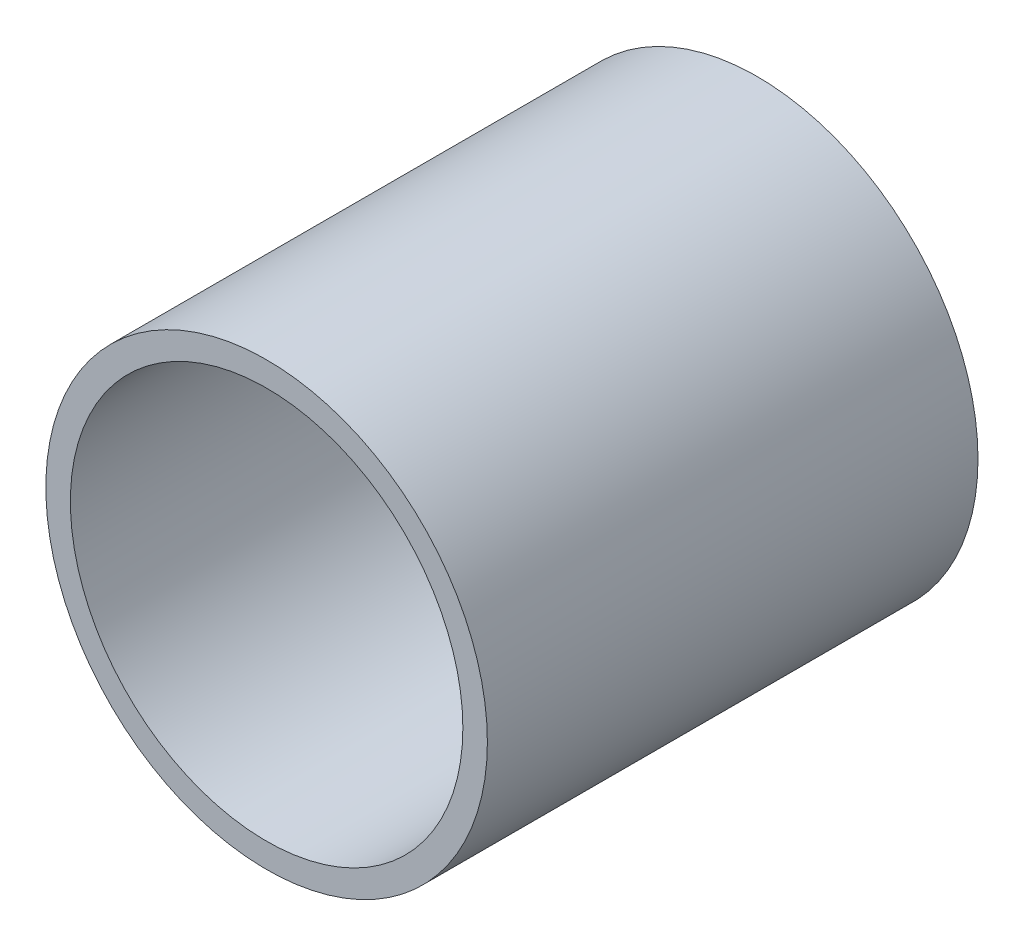
ISO-10303-21;
HEADER;
FILE_DESCRIPTION(('STEP AP214'),'2;1');
FILE_NAME('part.step','',(''),(''),'','','');
FILE_SCHEMA(('AUTOMOTIVE_DESIGN { 1 0 10303 214 1 1 1 1 }'));
ENDSEC;
DATA;
#1=APPLICATION_CONTEXT('core data for automotive mechanical design processes');
#2=APPLICATION_PROTOCOL_DEFINITION('international standard','automotive_design',2000,#1);
#3=PRODUCT_CONTEXT('',#1,'mechanical');
#4=PRODUCT('Part','Part','',(#3));
#5=PRODUCT_RELATED_PRODUCT_CATEGORY('part','',(#4));
#6=PRODUCT_DEFINITION_FORMATION('','',#4);
#7=PRODUCT_DEFINITION_CONTEXT('part definition',#1,'design');
#8=PRODUCT_DEFINITION('design','',#6,#7);
#9=PRODUCT_DEFINITION_SHAPE('','',#8);
#10=(LENGTH_UNIT() NAMED_UNIT(*) SI_UNIT(.MILLI.,.METRE.));
#11=(NAMED_UNIT(*) PLANE_ANGLE_UNIT() SI_UNIT($,.RADIAN.));
#12=(NAMED_UNIT(*) SI_UNIT($,.STERADIAN.) SOLID_ANGLE_UNIT());
#13=UNCERTAINTY_MEASURE_WITH_UNIT(LENGTH_MEASURE(1.E-05),#10,'distance_accuracy_value','');
#14=(GEOMETRIC_REPRESENTATION_CONTEXT(3) GLOBAL_UNCERTAINTY_ASSIGNED_CONTEXT((#13)) GLOBAL_UNIT_ASSIGNED_CONTEXT((#10,
#11,#12)) REPRESENTATION_CONTEXT('',''));
#15=CARTESIAN_POINT('',(0.,0.,0.));
#16=DIRECTION('',(0.,0.,1.));
#17=DIRECTION('',(1.,0.,0.));
#18=AXIS2_PLACEMENT_3D('',#15,#16,#17);
#19=CARTESIAN_POINT('',(0.,0.,31.75));
#20=DIRECTION('',(0.,0.,1.));
#21=DIRECTION('',(1.,0.,0.));
#22=AXIS2_PLACEMENT_3D('',#19,#20,#21);
#23=PLANE('',#22);
#24=CARTESIAN_POINT('',(0.,0.,31.75));
#25=DIRECTION('',(0.,0.,1.));
#26=DIRECTION('',(1.,0.,0.));
#27=AXIS2_PLACEMENT_3D('',#24,#25,#26);
#28=CIRCLE('',#27,28.575);
#29=CARTESIAN_POINT('',(28.575,0.,31.75));
#30=VERTEX_POINT('',#29);
#31=EDGE_CURVE('E10',#30,#30,#28,.T.);
#32=ORIENTED_EDGE('',*,*,#31,.T.);
#33=EDGE_LOOP('',(#32));
#34=FACE_BOUND('',#33,.T.);
#35=CARTESIAN_POINT('',(0.,0.,31.75));
#36=DIRECTION('',(0.,0.,1.));
#37=DIRECTION('',(1.,0.,0.));
#38=AXIS2_PLACEMENT_3D('',#35,#36,#37);
#39=CIRCLE('',#38,25.4);
#40=CARTESIAN_POINT('',(25.4,0.,31.75));
#41=VERTEX_POINT('',#40);
#42=EDGE_CURVE('E41',#41,#41,#39,.T.);
#43=ORIENTED_EDGE('',*,*,#42,.F.);
#44=EDGE_LOOP('',(#43));
#45=FACE_BOUND('',#44,.T.);
#46=ADVANCED_FACE('F30',(#34,#45),#23,.T.);
#47=CARTESIAN_POINT('',(0.,0.,-31.75));
#48=DIRECTION('',(0.,0.,1.));
#49=DIRECTION('',(1.,0.,0.));
#50=AXIS2_PLACEMENT_3D('',#47,#48,#49);
#51=PLANE('',#50);
#52=CARTESIAN_POINT('',(0.,0.,-31.75));
#53=DIRECTION('',(0.,0.,1.));
#54=DIRECTION('',(1.,0.,0.));
#55=AXIS2_PLACEMENT_3D('',#52,#53,#54);
#56=CIRCLE('',#55,28.575);
#57=CARTESIAN_POINT('',(28.575,0.,-31.75));
#58=VERTEX_POINT('',#57);
#59=EDGE_CURVE('E34',#58,#58,#56,.T.);
#60=ORIENTED_EDGE('',*,*,#59,.F.);
#61=EDGE_LOOP('',(#60));
#62=FACE_BOUND('',#61,.T.);
#63=CARTESIAN_POINT('',(0.,0.,-31.75));
#64=DIRECTION('',(0.,0.,1.));
#65=DIRECTION('',(1.,0.,0.));
#66=AXIS2_PLACEMENT_3D('',#63,#64,#65);
#67=CIRCLE('',#66,25.4);
#68=CARTESIAN_POINT('',(25.4,0.,-31.75));
#69=VERTEX_POINT('',#68);
#70=EDGE_CURVE('E43',#69,#69,#67,.T.);
#71=ORIENTED_EDGE('',*,*,#70,.T.);
#72=EDGE_LOOP('',(#71));
#73=FACE_BOUND('',#72,.T.);
#74=ADVANCED_FACE('F53',(#62,#73),#51,.F.);
#75=CARTESIAN_POINT('',(0.,0.,31.75));
#76=DIRECTION('',(0.,0.,-1.));
#77=DIRECTION('',(-1.,0.,0.));
#78=AXIS2_PLACEMENT_3D('',#75,#76,#77);
#79=CYLINDRICAL_SURFACE('',#78,28.575);
#80=ORIENTED_EDGE('',*,*,#31,.F.);
#81=EDGE_LOOP('',(#80));
#82=FACE_BOUND('',#81,.T.);
#83=ORIENTED_EDGE('',*,*,#59,.T.);
#84=EDGE_LOOP('',(#83));
#85=FACE_BOUND('',#84,.T.);
#86=ADVANCED_FACE('F32',(#82,#85),#79,.T.);
#87=CARTESIAN_POINT('',(0.,0.,31.75));
#88=DIRECTION('',(0.,0.,-1.));
#89=DIRECTION('',(-1.,0.,0.));
#90=AXIS2_PLACEMENT_3D('',#87,#88,#89);
#91=CYLINDRICAL_SURFACE('',#90,25.4);
#92=ORIENTED_EDGE('',*,*,#42,.T.);
#93=EDGE_LOOP('',(#92));
#94=FACE_BOUND('',#93,.T.);
#95=ORIENTED_EDGE('',*,*,#70,.F.);
#96=EDGE_LOOP('',(#95));
#97=FACE_BOUND('',#96,.T.);
#98=ADVANCED_FACE('F49',(#94,#97),#91,.F.);
#99=CLOSED_SHELL('',(#46,#74,#86,#98));
#100=MANIFOLD_SOLID_BREP('B2',#99);
#101=ADVANCED_BREP_SHAPE_REPRESENTATION('',(#18,#100),#14);
#102=SHAPE_DEFINITION_REPRESENTATION(#9,#101);
ENDSEC;
END-ISO-10303-21;
